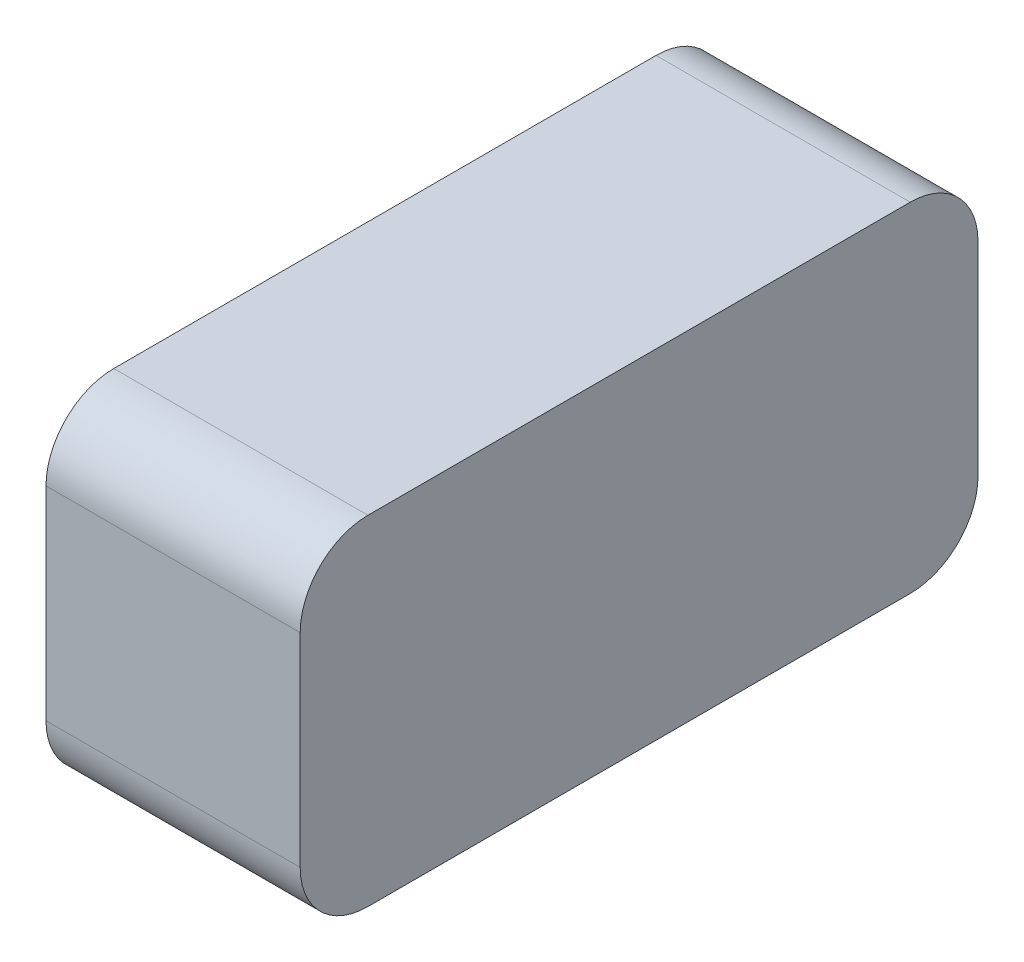
ISO-10303-21;
HEADER;
FILE_DESCRIPTION(('STEP AP214'),'2;1');
FILE_NAME('part.step','',(''),(''),'','','');
FILE_SCHEMA(('AUTOMOTIVE_DESIGN { 1 0 10303 214 1 1 1 1 }'));
ENDSEC;
DATA;
#1=APPLICATION_CONTEXT('core data for automotive mechanical design processes');
#2=APPLICATION_PROTOCOL_DEFINITION('international standard','automotive_design',2000,#1);
#3=PRODUCT_CONTEXT('',#1,'mechanical');
#4=PRODUCT('Part','Part','',(#3));
#5=PRODUCT_RELATED_PRODUCT_CATEGORY('part','',(#4));
#6=PRODUCT_DEFINITION_FORMATION('','',#4);
#7=PRODUCT_DEFINITION_CONTEXT('part definition',#1,'design');
#8=PRODUCT_DEFINITION('design','',#6,#7);
#9=PRODUCT_DEFINITION_SHAPE('','',#8);
#10=(LENGTH_UNIT() NAMED_UNIT(*) SI_UNIT(.MILLI.,.METRE.));
#11=(NAMED_UNIT(*) PLANE_ANGLE_UNIT() SI_UNIT($,.RADIAN.));
#12=(NAMED_UNIT(*) SI_UNIT($,.STERADIAN.) SOLID_ANGLE_UNIT());
#13=UNCERTAINTY_MEASURE_WITH_UNIT(LENGTH_MEASURE(1.E-05),#10,'distance_accuracy_value','');
#14=(GEOMETRIC_REPRESENTATION_CONTEXT(3) GLOBAL_UNCERTAINTY_ASSIGNED_CONTEXT((#13)) GLOBAL_UNIT_ASSIGNED_CONTEXT((#10,
#11,#12)) REPRESENTATION_CONTEXT('',''));
#15=CARTESIAN_POINT('',(0.,0.,0.));
#16=DIRECTION('',(0.,0.,1.));
#17=DIRECTION('',(1.,0.,0.));
#18=AXIS2_PLACEMENT_3D('',#15,#16,#17);
#19=CARTESIAN_POINT('',(15.,20.,-40.));
#20=DIRECTION('',(0.,0.,1.));
#21=DIRECTION('',(1.,0.,0.));
#22=AXIS2_PLACEMENT_3D('',#19,#20,#21);
#23=PLANE('',#22);
#24=DIRECTION('',(0.,1.,0.));
#25=VECTOR('',#24,1.);
#26=CARTESIAN_POINT('',(15.,20.,-40.));
#27=LINE('',#26,#25);
#28=CARTESIAN_POINT('',(15.,-12.,-40.));
#29=VERTEX_POINT('',#28);
#30=CARTESIAN_POINT('',(15.,12.,-40.));
#31=VERTEX_POINT('',#30);
#32=EDGE_CURVE('E119',#29,#31,#27,.T.);
#33=ORIENTED_EDGE('',*,*,#32,.F.);
#34=DIRECTION('',(-1.,0.,0.));
#35=VECTOR('',#34,1.);
#36=CARTESIAN_POINT('',(15.,-12.,-40.));
#37=LINE('',#36,#35);
#38=CARTESIAN_POINT('',(-15.,-12.,-40.));
#39=VERTEX_POINT('',#38);
#40=EDGE_CURVE('E104',#29,#39,#37,.T.);
#41=ORIENTED_EDGE('',*,*,#40,.T.);
#42=DIRECTION('',(0.,1.,0.));
#43=VECTOR('',#42,1.);
#44=CARTESIAN_POINT('',(-15.,20.,-40.));
#45=LINE('',#44,#43);
#46=CARTESIAN_POINT('',(-15.,12.,-40.));
#47=VERTEX_POINT('',#46);
#48=EDGE_CURVE('E116',#39,#47,#45,.T.);
#49=ORIENTED_EDGE('',*,*,#48,.T.);
#50=DIRECTION('',(-1.,0.,0.));
#51=VECTOR('',#50,1.);
#52=CARTESIAN_POINT('',(15.,12.,-40.));
#53=LINE('',#52,#51);
#54=EDGE_CURVE('E121',#47,#31,#53,.F.);
#55=ORIENTED_EDGE('',*,*,#54,.T.);
#56=EDGE_LOOP('',(#33,#41,#49,#55));
#57=FACE_BOUND('',#56,.T.);
#58=ADVANCED_FACE('F33',(#57),#23,.F.);
#59=CARTESIAN_POINT('',(15.,20.,40.));
#60=DIRECTION('',(0.,-1.,0.));
#61=DIRECTION('',(0.,0.,-1.));
#62=AXIS2_PLACEMENT_3D('',#59,#60,#61);
#63=PLANE('',#62);
#64=DIRECTION('',(0.,0.,1.));
#65=VECTOR('',#64,1.);
#66=CARTESIAN_POINT('',(15.,20.,40.));
#67=LINE('',#66,#65);
#68=CARTESIAN_POINT('',(15.,20.,-32.));
#69=VERTEX_POINT('',#68);
#70=CARTESIAN_POINT('',(15.,20.,32.));
#71=VERTEX_POINT('',#70);
#72=EDGE_CURVE('E215',#69,#71,#67,.T.);
#73=ORIENTED_EDGE('',*,*,#72,.F.);
#74=DIRECTION('',(-1.,0.,0.));
#75=VECTOR('',#74,1.);
#76=CARTESIAN_POINT('',(15.,20.,-32.));
#77=LINE('',#76,#75);
#78=CARTESIAN_POINT('',(-15.,20.,-32.));
#79=VERTEX_POINT('',#78);
#80=EDGE_CURVE('E161',#69,#79,#77,.T.);
#81=ORIENTED_EDGE('',*,*,#80,.T.);
#82=DIRECTION('',(0.,0.,1.));
#83=VECTOR('',#82,1.);
#84=CARTESIAN_POINT('',(-15.,20.,40.));
#85=LINE('',#84,#83);
#86=CARTESIAN_POINT('',(-15.,20.,32.));
#87=VERTEX_POINT('',#86);
#88=EDGE_CURVE('E126',#79,#87,#85,.T.);
#89=ORIENTED_EDGE('',*,*,#88,.T.);
#90=DIRECTION('',(-1.,0.,0.));
#91=VECTOR('',#90,1.);
#92=CARTESIAN_POINT('',(15.,20.,32.));
#93=LINE('',#92,#91);
#94=EDGE_CURVE('E159',#87,#71,#93,.F.);
#95=ORIENTED_EDGE('',*,*,#94,.T.);
#96=EDGE_LOOP('',(#73,#81,#89,#95));
#97=FACE_BOUND('',#96,.T.);
#98=ADVANCED_FACE('F179',(#97),#63,.F.);
#99=CARTESIAN_POINT('',(15.,20.,40.));
#100=DIRECTION('',(0.,0.,-1.));
#101=DIRECTION('',(-1.,0.,0.));
#102=AXIS2_PLACEMENT_3D('',#99,#100,#101);
#103=PLANE('',#102);
#104=DIRECTION('',(0.,-1.,0.));
#105=VECTOR('',#104,1.);
#106=CARTESIAN_POINT('',(-15.,20.,40.));
#107=LINE('',#106,#105);
#108=CARTESIAN_POINT('',(-15.,12.,40.));
#109=VERTEX_POINT('',#108);
#110=CARTESIAN_POINT('',(-15.,-12.,40.));
#111=VERTEX_POINT('',#110);
#112=EDGE_CURVE('E130',#109,#111,#107,.T.);
#113=ORIENTED_EDGE('',*,*,#112,.T.);
#114=DIRECTION('',(-1.,0.,0.));
#115=VECTOR('',#114,1.);
#116=CARTESIAN_POINT('',(15.,-12.,40.));
#117=LINE('',#116,#115);
#118=CARTESIAN_POINT('',(15.,-12.,40.));
#119=VERTEX_POINT('',#118);
#120=EDGE_CURVE('E48',#111,#119,#117,.F.);
#121=ORIENTED_EDGE('',*,*,#120,.T.);
#122=DIRECTION('',(0.,-1.,0.));
#123=VECTOR('',#122,1.);
#124=CARTESIAN_POINT('',(15.,20.,40.));
#125=LINE('',#124,#123);
#126=CARTESIAN_POINT('',(15.,12.,40.));
#127=VERTEX_POINT('',#126);
#128=EDGE_CURVE('E208',#127,#119,#125,.T.);
#129=ORIENTED_EDGE('',*,*,#128,.F.);
#130=DIRECTION('',(-1.,0.,0.));
#131=VECTOR('',#130,1.);
#132=CARTESIAN_POINT('',(15.,12.,40.));
#133=LINE('',#132,#131);
#134=EDGE_CURVE('E155',#127,#109,#133,.T.);
#135=ORIENTED_EDGE('',*,*,#134,.T.);
#136=EDGE_LOOP('',(#113,#121,#129,#135));
#137=FACE_BOUND('',#136,.T.);
#138=ADVANCED_FACE('F184',(#137),#103,.F.);
#139=CARTESIAN_POINT('',(15.,-20.,40.));
#140=DIRECTION('',(0.,1.,0.));
#141=DIRECTION('',(0.,0.,1.));
#142=AXIS2_PLACEMENT_3D('',#139,#140,#141);
#143=PLANE('',#142);
#144=DIRECTION('',(0.,0.,-1.));
#145=VECTOR('',#144,1.);
#146=CARTESIAN_POINT('',(-15.,-20.,40.));
#147=LINE('',#146,#145);
#148=CARTESIAN_POINT('',(-15.,-20.,32.));
#149=VERTEX_POINT('',#148);
#150=CARTESIAN_POINT('',(-15.,-20.,-32.));
#151=VERTEX_POINT('',#150);
#152=EDGE_CURVE('E139',#149,#151,#147,.T.);
#153=ORIENTED_EDGE('',*,*,#152,.T.);
#154=DIRECTION('',(-1.,0.,0.));
#155=VECTOR('',#154,1.);
#156=CARTESIAN_POINT('',(15.,-20.,-32.));
#157=LINE('',#156,#155);
#158=CARTESIAN_POINT('',(15.,-20.,-32.));
#159=VERTEX_POINT('',#158);
#160=EDGE_CURVE('E105',#151,#159,#157,.F.);
#161=ORIENTED_EDGE('',*,*,#160,.T.);
#162=DIRECTION('',(0.,0.,-1.));
#163=VECTOR('',#162,1.);
#164=CARTESIAN_POINT('',(15.,-20.,40.));
#165=LINE('',#164,#163);
#166=CARTESIAN_POINT('',(15.,-20.,32.));
#167=VERTEX_POINT('',#166);
#168=EDGE_CURVE('E135',#167,#159,#165,.T.);
#169=ORIENTED_EDGE('',*,*,#168,.F.);
#170=DIRECTION('',(-1.,0.,0.));
#171=VECTOR('',#170,1.);
#172=CARTESIAN_POINT('',(15.,-20.,32.));
#173=LINE('',#172,#171);
#174=EDGE_CURVE('E110',#167,#149,#173,.T.);
#175=ORIENTED_EDGE('',*,*,#174,.T.);
#176=EDGE_LOOP('',(#153,#161,#169,#175));
#177=FACE_BOUND('',#176,.T.);
#178=ADVANCED_FACE('F213',(#177),#143,.F.);
#179=CARTESIAN_POINT('',(15.,0.,0.));
#180=DIRECTION('',(1.,0.,0.));
#181=DIRECTION('',(0.,0.,-1.));
#182=AXIS2_PLACEMENT_3D('',#179,#180,#181);
#183=PLANE('',#182);
#184=ORIENTED_EDGE('',*,*,#168,.T.);
#185=CARTESIAN_POINT('',(15.,-12.,-32.));
#186=DIRECTION('',(1.,0.,0.));
#187=DIRECTION('',(0.,0.,-1.));
#188=AXIS2_PLACEMENT_3D('',#185,#186,#187);
#189=CIRCLE('',#188,8.);
#190=EDGE_CURVE('E153',#159,#29,#189,.T.);
#191=ORIENTED_EDGE('',*,*,#190,.T.);
#192=ORIENTED_EDGE('',*,*,#32,.T.);
#193=CARTESIAN_POINT('',(15.,12.,-32.));
#194=DIRECTION('',(1.,0.,0.));
#195=DIRECTION('',(0.,0.,-1.));
#196=AXIS2_PLACEMENT_3D('',#193,#194,#195);
#197=CIRCLE('',#196,8.);
#198=EDGE_CURVE('E149',#31,#69,#197,.T.);
#199=ORIENTED_EDGE('',*,*,#198,.T.);
#200=ORIENTED_EDGE('',*,*,#72,.T.);
#201=CARTESIAN_POINT('',(15.,12.,32.));
#202=DIRECTION('',(1.,0.,0.));
#203=DIRECTION('',(0.,0.,-1.));
#204=AXIS2_PLACEMENT_3D('',#201,#202,#203);
#205=CIRCLE('',#204,8.);
#206=EDGE_CURVE('E55',#71,#127,#205,.T.);
#207=ORIENTED_EDGE('',*,*,#206,.T.);
#208=ORIENTED_EDGE('',*,*,#128,.T.);
#209=CARTESIAN_POINT('',(15.,-12.,32.));
#210=DIRECTION('',(1.,0.,0.));
#211=DIRECTION('',(0.,0.,-1.));
#212=AXIS2_PLACEMENT_3D('',#209,#210,#211);
#213=CIRCLE('',#212,8.);
#214=EDGE_CURVE('E151',#119,#167,#213,.T.);
#215=ORIENTED_EDGE('',*,*,#214,.T.);
#216=EDGE_LOOP('',(#184,#191,#192,#199,#200,#207,#208,#215));
#217=FACE_BOUND('',#216,.T.);
#218=ADVANCED_FACE('F219',(#217),#183,.T.);
#219=CARTESIAN_POINT('',(-15.,0.,0.));
#220=DIRECTION('',(1.,0.,0.));
#221=DIRECTION('',(0.,0.,-1.));
#222=AXIS2_PLACEMENT_3D('',#219,#220,#221);
#223=PLANE('',#222);
#224=CARTESIAN_POINT('',(-15.,0.,0.));
#225=DIRECTION('',(1.,0.,0.));
#226=DIRECTION('',(0.,0.,-1.));
#227=AXIS2_PLACEMENT_3D('',#224,#225,#226);
#228=CIRCLE('',#227,13.);
#229=CARTESIAN_POINT('',(-15.,0.,-13.));
#230=VERTEX_POINT('',#229);
#231=EDGE_CURVE('E11',#230,#230,#228,.T.);
#232=ORIENTED_EDGE('',*,*,#231,.T.);
#233=EDGE_LOOP('',(#232));
#234=FACE_BOUND('',#233,.T.);
#235=ORIENTED_EDGE('',*,*,#48,.F.);
#236=CARTESIAN_POINT('',(-15.,-12.,-32.));
#237=DIRECTION('',(1.,0.,0.));
#238=DIRECTION('',(0.,0.,-1.));
#239=AXIS2_PLACEMENT_3D('',#236,#237,#238);
#240=CIRCLE('',#239,8.);
#241=EDGE_CURVE('E100',#39,#151,#240,.F.);
#242=ORIENTED_EDGE('',*,*,#241,.T.);
#243=ORIENTED_EDGE('',*,*,#152,.F.);
#244=CARTESIAN_POINT('',(-15.,-12.,32.));
#245=DIRECTION('',(1.,0.,0.));
#246=DIRECTION('',(0.,0.,-1.));
#247=AXIS2_PLACEMENT_3D('',#244,#245,#246);
#248=CIRCLE('',#247,8.);
#249=EDGE_CURVE('E111',#149,#111,#248,.F.);
#250=ORIENTED_EDGE('',*,*,#249,.T.);
#251=ORIENTED_EDGE('',*,*,#112,.F.);
#252=CARTESIAN_POINT('',(-15.,12.,32.));
#253=DIRECTION('',(1.,0.,0.));
#254=DIRECTION('',(0.,0.,-1.));
#255=AXIS2_PLACEMENT_3D('',#252,#253,#254);
#256=CIRCLE('',#255,8.);
#257=EDGE_CURVE('E120',#109,#87,#256,.F.);
#258=ORIENTED_EDGE('',*,*,#257,.T.);
#259=ORIENTED_EDGE('',*,*,#88,.F.);
#260=CARTESIAN_POINT('',(-15.,12.,-32.));
#261=DIRECTION('',(1.,0.,0.));
#262=DIRECTION('',(0.,0.,-1.));
#263=AXIS2_PLACEMENT_3D('',#260,#261,#262);
#264=CIRCLE('',#263,8.);
#265=EDGE_CURVE('E125',#79,#47,#264,.F.);
#266=ORIENTED_EDGE('',*,*,#265,.T.);
#267=EDGE_LOOP('',(#235,#242,#243,#250,#251,#258,#259,#266));
#268=FACE_BOUND('',#267,.T.);
#269=ADVANCED_FACE('F123',(#234,#268),#223,.F.);
#270=CARTESIAN_POINT('',(15.,-12.,-32.));
#271=DIRECTION('',(-1.,0.,0.));
#272=DIRECTION('',(0.,0.,1.));
#273=AXIS2_PLACEMENT_3D('',#270,#271,#272);
#274=CYLINDRICAL_SURFACE('',#273,8.);
#275=ORIENTED_EDGE('',*,*,#190,.F.);
#276=ORIENTED_EDGE('',*,*,#160,.F.);
#277=ORIENTED_EDGE('',*,*,#241,.F.);
#278=ORIENTED_EDGE('',*,*,#40,.F.);
#279=EDGE_LOOP('',(#275,#276,#277,#278));
#280=FACE_BOUND('',#279,.T.);
#281=ADVANCED_FACE('F103',(#280),#274,.T.);
#282=CARTESIAN_POINT('',(15.,-12.,32.));
#283=DIRECTION('',(-1.,0.,0.));
#284=DIRECTION('',(0.,0.,1.));
#285=AXIS2_PLACEMENT_3D('',#282,#283,#284);
#286=CYLINDRICAL_SURFACE('',#285,8.);
#287=ORIENTED_EDGE('',*,*,#214,.F.);
#288=ORIENTED_EDGE('',*,*,#120,.F.);
#289=ORIENTED_EDGE('',*,*,#249,.F.);
#290=ORIENTED_EDGE('',*,*,#174,.F.);
#291=EDGE_LOOP('',(#287,#288,#289,#290));
#292=FACE_BOUND('',#291,.T.);
#293=ADVANCED_FACE('F191',(#292),#286,.T.);
#294=CARTESIAN_POINT('',(15.,12.,-32.));
#295=DIRECTION('',(-1.,0.,0.));
#296=DIRECTION('',(0.,0.,1.));
#297=AXIS2_PLACEMENT_3D('',#294,#295,#296);
#298=CYLINDRICAL_SURFACE('',#297,8.);
#299=ORIENTED_EDGE('',*,*,#198,.F.);
#300=ORIENTED_EDGE('',*,*,#54,.F.);
#301=ORIENTED_EDGE('',*,*,#265,.F.);
#302=ORIENTED_EDGE('',*,*,#80,.F.);
#303=EDGE_LOOP('',(#299,#300,#301,#302));
#304=FACE_BOUND('',#303,.T.);
#305=ADVANCED_FACE('F194',(#304),#298,.T.);
#306=CARTESIAN_POINT('',(15.,12.,32.));
#307=DIRECTION('',(-1.,0.,0.));
#308=DIRECTION('',(0.,0.,1.));
#309=AXIS2_PLACEMENT_3D('',#306,#307,#308);
#310=CYLINDRICAL_SURFACE('',#309,8.);
#311=ORIENTED_EDGE('',*,*,#206,.F.);
#312=ORIENTED_EDGE('',*,*,#94,.F.);
#313=ORIENTED_EDGE('',*,*,#257,.F.);
#314=ORIENTED_EDGE('',*,*,#134,.F.);
#315=EDGE_LOOP('',(#311,#312,#313,#314));
#316=FACE_BOUND('',#315,.T.);
#317=ADVANCED_FACE('F197',(#316),#310,.T.);
#318=CARTESIAN_POINT('',(-20.,0.,0.));
#319=DIRECTION('',(1.,0.,0.));
#320=DIRECTION('',(0.,0.,-1.));
#321=AXIS2_PLACEMENT_3D('',#318,#319,#320);
#322=CYLINDRICAL_SURFACE('',#321,10.);
#323=CARTESIAN_POINT('',(-18.,0.,0.));
#324=DIRECTION('',(1.,0.,0.));
#325=DIRECTION('',(0.,0.,-1.));
#326=AXIS2_PLACEMENT_3D('',#323,#324,#325);
#327=CIRCLE('',#326,10.);
#328=CARTESIAN_POINT('',(-18.,0.,-10.));
#329=VERTEX_POINT('',#328);
#330=EDGE_CURVE('E41',#329,#329,#327,.F.);
#331=ORIENTED_EDGE('',*,*,#330,.T.);
#332=EDGE_LOOP('',(#331));
#333=FACE_BOUND('',#332,.T.);
#334=CARTESIAN_POINT('',(-20.,0.,0.));
#335=DIRECTION('',(-1.,0.,0.));
#336=DIRECTION('',(0.,0.,1.));
#337=AXIS2_PLACEMENT_3D('',#334,#335,#336);
#338=CIRCLE('',#337,10.);
#339=CARTESIAN_POINT('',(-20.,0.,10.));
#340=VERTEX_POINT('',#339);
#341=EDGE_CURVE('E127',#340,#340,#338,.T.);
#342=ORIENTED_EDGE('',*,*,#341,.F.);
#343=EDGE_LOOP('',(#342));
#344=FACE_BOUND('',#343,.T.);
#345=ADVANCED_FACE('F166',(#333,#344),#322,.T.);
#346=CARTESIAN_POINT('',(-20.,0.,0.));
#347=DIRECTION('',(-1.,0.,0.));
#348=DIRECTION('',(0.,0.,1.));
#349=AXIS2_PLACEMENT_3D('',#346,#347,#348);
#350=PLANE('',#349);
#351=ORIENTED_EDGE('',*,*,#341,.T.);
#352=EDGE_LOOP('',(#351));
#353=FACE_BOUND('',#352,.T.);
#354=ADVANCED_FACE('F170',(#353),#350,.T.);
#355=CARTESIAN_POINT('',(-18.,0.,0.));
#356=DIRECTION('',(1.,0.,0.));
#357=DIRECTION('',(0.,0.,-1.));
#358=AXIS2_PLACEMENT_3D('',#355,#356,#357);
#359=TOROIDAL_SURFACE('',#358,13.,3.);
#360=ORIENTED_EDGE('',*,*,#231,.F.);
#361=EDGE_LOOP('',(#360));
#362=FACE_BOUND('',#361,.T.);
#363=ORIENTED_EDGE('',*,*,#330,.F.);
#364=EDGE_LOOP('',(#363));
#365=FACE_BOUND('',#364,.T.);
#366=ADVANCED_FACE('F35',(#362,#365),#359,.F.);
#367=CLOSED_SHELL('',(#58,#98,#138,#178,#218,#269,#281,#293,#305,#317,#345,#354,#366));
#368=MANIFOLD_SOLID_BREP('B2',#367);
#369=ADVANCED_BREP_SHAPE_REPRESENTATION('',(#18,#368),#14);
#370=SHAPE_DEFINITION_REPRESENTATION(#9,#369);
ENDSEC;
END-ISO-10303-21;
